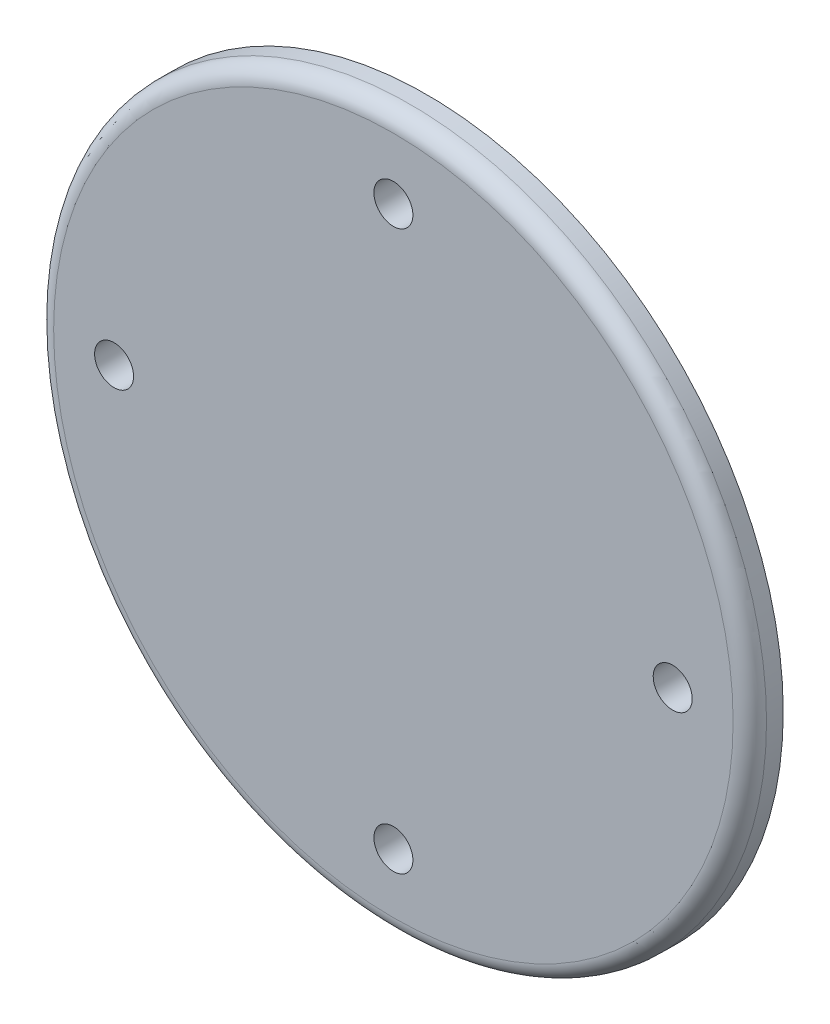
ISO-10303-21;
HEADER;
FILE_DESCRIPTION(('STEP AP214'),'2;1');
FILE_NAME('part.step','',(''),(''),'','','');
FILE_SCHEMA(('AUTOMOTIVE_DESIGN { 1 0 10303 214 1 1 1 1 }'));
ENDSEC;
DATA;
#1=APPLICATION_CONTEXT('core data for automotive mechanical design processes');
#2=APPLICATION_PROTOCOL_DEFINITION('international standard','automotive_design',2000,#1);
#3=PRODUCT_CONTEXT('',#1,'mechanical');
#4=PRODUCT('Part','Part','',(#3));
#5=PRODUCT_RELATED_PRODUCT_CATEGORY('part','',(#4));
#6=PRODUCT_DEFINITION_FORMATION('','',#4);
#7=PRODUCT_DEFINITION_CONTEXT('part definition',#1,'design');
#8=PRODUCT_DEFINITION('design','',#6,#7);
#9=PRODUCT_DEFINITION_SHAPE('','',#8);
#10=(LENGTH_UNIT() NAMED_UNIT(*) SI_UNIT(.MILLI.,.METRE.));
#11=(NAMED_UNIT(*) PLANE_ANGLE_UNIT() SI_UNIT($,.RADIAN.));
#12=(NAMED_UNIT(*) SI_UNIT($,.STERADIAN.) SOLID_ANGLE_UNIT());
#13=UNCERTAINTY_MEASURE_WITH_UNIT(LENGTH_MEASURE(1.E-05),#10,'distance_accuracy_value','');
#14=(GEOMETRIC_REPRESENTATION_CONTEXT(3) GLOBAL_UNCERTAINTY_ASSIGNED_CONTEXT((#13)) GLOBAL_UNIT_ASSIGNED_CONTEXT((#10,
#11,#12)) REPRESENTATION_CONTEXT('',''));
#15=CARTESIAN_POINT('',(0.,0.,0.));
#16=DIRECTION('',(0.,0.,1.));
#17=DIRECTION('',(1.,0.,0.));
#18=AXIS2_PLACEMENT_3D('',#15,#16,#17);
#19=CARTESIAN_POINT('',(0.,0.,30.7823439878234));
#20=DIRECTION('',(0.,0.,1.));
#21=DIRECTION('',(1.,0.,0.));
#22=AXIS2_PLACEMENT_3D('',#19,#20,#21);
#23=CYLINDRICAL_SURFACE('',#22,64.);
#24=CARTESIAN_POINT('',(0.,0.,-3.));
#25=DIRECTION('',(0.,0.,-1.));
#26=DIRECTION('',(-1.,0.,0.));
#27=AXIS2_PLACEMENT_3D('',#24,#25,#26);
#28=CIRCLE('',#27,64.);
#29=CARTESIAN_POINT('',(-64.,0.,-3.));
#30=VERTEX_POINT('',#29);
#31=EDGE_CURVE('E53',#30,#30,#28,.T.);
#32=ORIENTED_EDGE('',*,*,#31,.T.);
#33=EDGE_LOOP('',(#32));
#34=FACE_BOUND('',#33,.T.);
#35=CARTESIAN_POINT('',(0.,0.,-6.));
#36=DIRECTION('',(0.,0.,1.));
#37=DIRECTION('',(1.,0.,0.));
#38=AXIS2_PLACEMENT_3D('',#35,#36,#37);
#39=CIRCLE('',#38,64.);
#40=CARTESIAN_POINT('',(64.,0.,-6.));
#41=VERTEX_POINT('',#40);
#42=EDGE_CURVE('E59',#41,#41,#39,.T.);
#43=ORIENTED_EDGE('',*,*,#42,.T.);
#44=EDGE_LOOP('',(#43));
#45=FACE_BOUND('',#44,.T.);
#46=ADVANCED_FACE('F33',(#34,#45),#23,.T.);
#47=CARTESIAN_POINT('',(0.,64.,-6.));
#48=DIRECTION('',(0.,0.,1.));
#49=DIRECTION('',(1.,0.,0.));
#50=AXIS2_PLACEMENT_3D('',#47,#48,#49);
#51=PLANE('',#50);
#52=CARTESIAN_POINT('',(0.,0.,-6.));
#53=DIRECTION('',(0.,0.,1.));
#54=DIRECTION('',(1.,0.,0.));
#55=AXIS2_PLACEMENT_3D('',#52,#53,#54);
#56=CIRCLE('',#55,35.);
#57=CARTESIAN_POINT('',(35.,0.,-6.));
#58=VERTEX_POINT('',#57);
#59=EDGE_CURVE('E48',#58,#58,#56,.T.);
#60=ORIENTED_EDGE('',*,*,#59,.T.);
#61=EDGE_LOOP('',(#60));
#62=FACE_BOUND('',#61,.T.);
#63=CARTESIAN_POINT('',(-50.1499846954392,-0.149984695439408,-6.));
#64=DIRECTION('',(0.,0.,1.));
#65=DIRECTION('',(1.,0.,0.));
#66=AXIS2_PLACEMENT_3D('',#63,#64,#65);
#67=CIRCLE('',#66,3.5);
#68=CARTESIAN_POINT('',(-46.6499846954392,-0.149984695439408,-6.));
#69=VERTEX_POINT('',#68);
#70=EDGE_CURVE('E74',#69,#69,#67,.F.);
#71=ORIENTED_EDGE('',*,*,#70,.F.);
#72=EDGE_LOOP('',(#71));
#73=FACE_BOUND('',#72,.T.);
#74=CARTESIAN_POINT('',(0.,-50.2999693908785,-6.));
#75=DIRECTION('',(0.,0.,1.));
#76=DIRECTION('',(1.,0.,0.));
#77=AXIS2_PLACEMENT_3D('',#74,#75,#76);
#78=CIRCLE('',#77,3.5);
#79=CARTESIAN_POINT('',(3.5,-50.2999693908785,-6.));
#80=VERTEX_POINT('',#79);
#81=EDGE_CURVE('E82',#80,#80,#78,.F.);
#82=ORIENTED_EDGE('',*,*,#81,.F.);
#83=EDGE_LOOP('',(#82));
#84=FACE_BOUND('',#83,.T.);
#85=CARTESIAN_POINT('',(50.1499846954392,-0.149984695438708,-6.));
#86=DIRECTION('',(0.,0.,1.));
#87=DIRECTION('',(1.,0.,0.));
#88=AXIS2_PLACEMENT_3D('',#85,#86,#87);
#89=CIRCLE('',#88,3.5);
#90=CARTESIAN_POINT('',(53.6499846954392,-0.149984695438708,-6.));
#91=VERTEX_POINT('',#90);
#92=EDGE_CURVE('E75',#91,#91,#89,.F.);
#93=ORIENTED_EDGE('',*,*,#92,.F.);
#94=EDGE_LOOP('',(#93));
#95=FACE_BOUND('',#94,.T.);
#96=CARTESIAN_POINT('',(0.,50.,-6.));
#97=DIRECTION('',(0.,0.,1.));
#98=DIRECTION('',(1.,0.,0.));
#99=AXIS2_PLACEMENT_3D('',#96,#97,#98);
#100=CIRCLE('',#99,3.5);
#101=CARTESIAN_POINT('',(3.5,50.,-6.));
#102=VERTEX_POINT('',#101);
#103=EDGE_CURVE('E68',#102,#102,#100,.F.);
#104=ORIENTED_EDGE('',*,*,#103,.F.);
#105=EDGE_LOOP('',(#104));
#106=FACE_BOUND('',#105,.T.);
#107=ORIENTED_EDGE('',*,*,#42,.F.);
#108=EDGE_LOOP('',(#107));
#109=FACE_BOUND('',#108,.T.);
#110=ADVANCED_FACE('F115',(#62,#73,#84,#95,#106,#109),#51,.F.);
#111=CARTESIAN_POINT('',(0.,0.,30.7823439878234));
#112=DIRECTION('',(0.,0.,1.));
#113=DIRECTION('',(1.,0.,0.));
#114=AXIS2_PLACEMENT_3D('',#111,#112,#113);
#115=CYLINDRICAL_SURFACE('',#114,34.);
#116=CARTESIAN_POINT('',(0.,0.,-7.));
#117=DIRECTION('',(0.,0.,1.));
#118=DIRECTION('',(1.,0.,0.));
#119=AXIS2_PLACEMENT_3D('',#116,#117,#118);
#120=CIRCLE('',#119,34.);
#121=CARTESIAN_POINT('',(34.,0.,-7.));
#122=VERTEX_POINT('',#121);
#123=EDGE_CURVE('E44',#122,#122,#120,.F.);
#124=ORIENTED_EDGE('',*,*,#123,.T.);
#125=EDGE_LOOP('',(#124));
#126=FACE_BOUND('',#125,.T.);
#127=CARTESIAN_POINT('',(0.,0.,-16.));
#128=DIRECTION('',(0.,0.,1.));
#129=DIRECTION('',(1.,0.,0.));
#130=AXIS2_PLACEMENT_3D('',#127,#128,#129);
#131=CIRCLE('',#130,34.);
#132=CARTESIAN_POINT('',(34.,0.,-16.));
#133=VERTEX_POINT('',#132);
#134=EDGE_CURVE('E62',#133,#133,#131,.T.);
#135=ORIENTED_EDGE('',*,*,#134,.T.);
#136=EDGE_LOOP('',(#135));
#137=FACE_BOUND('',#136,.T.);
#138=ADVANCED_FACE('F118',(#126,#137),#115,.T.);
#139=CARTESIAN_POINT('',(0.,34.,-16.));
#140=DIRECTION('',(0.,0.,1.));
#141=DIRECTION('',(1.,0.,0.));
#142=AXIS2_PLACEMENT_3D('',#139,#140,#141);
#143=PLANE('',#142);
#144=ORIENTED_EDGE('',*,*,#134,.F.);
#145=EDGE_LOOP('',(#144));
#146=FACE_BOUND('',#145,.T.);
#147=CARTESIAN_POINT('',(0.,0.,-16.));
#148=DIRECTION('',(0.,0.,1.));
#149=DIRECTION('',(1.,0.,0.));
#150=AXIS2_PLACEMENT_3D('',#147,#148,#149);
#151=CIRCLE('',#150,29.);
#152=CARTESIAN_POINT('',(29.,0.,-16.));
#153=VERTEX_POINT('',#152);
#154=EDGE_CURVE('E65',#153,#153,#151,.T.);
#155=ORIENTED_EDGE('',*,*,#154,.T.);
#156=EDGE_LOOP('',(#155));
#157=FACE_BOUND('',#156,.T.);
#158=ADVANCED_FACE('F166',(#146,#157),#143,.F.);
#159=CARTESIAN_POINT('',(0.,0.,30.7823439878234));
#160=DIRECTION('',(0.,0.,1.));
#161=DIRECTION('',(1.,0.,0.));
#162=AXIS2_PLACEMENT_3D('',#159,#160,#161);
#163=CYLINDRICAL_SURFACE('',#162,29.);
#164=CARTESIAN_POINT('',(0.,0.,-11.));
#165=DIRECTION('',(0.,0.,1.));
#166=DIRECTION('',(1.,0.,0.));
#167=AXIS2_PLACEMENT_3D('',#164,#165,#166);
#168=CIRCLE('',#167,29.);
#169=CARTESIAN_POINT('',(29.,0.,-11.));
#170=VERTEX_POINT('',#169);
#171=EDGE_CURVE('E40',#170,#170,#168,.T.);
#172=ORIENTED_EDGE('',*,*,#171,.T.);
#173=EDGE_LOOP('',(#172));
#174=FACE_BOUND('',#173,.T.);
#175=ORIENTED_EDGE('',*,*,#154,.F.);
#176=EDGE_LOOP('',(#175));
#177=FACE_BOUND('',#176,.T.);
#178=ADVANCED_FACE('F163',(#174,#177),#163,.F.);
#179=CARTESIAN_POINT('',(0.,29.,-6.00000000000001));
#180=DIRECTION('',(0.,0.,1.));
#181=DIRECTION('',(1.,0.,0.));
#182=AXIS2_PLACEMENT_3D('',#179,#180,#181);
#183=PLANE('',#182);
#184=CARTESIAN_POINT('',(0.,0.,-6.00000000000001));
#185=DIRECTION('',(0.,0.,1.));
#186=DIRECTION('',(1.,0.,0.));
#187=AXIS2_PLACEMENT_3D('',#184,#185,#186);
#188=CIRCLE('',#187,24.);
#189=CARTESIAN_POINT('',(24.,0.,-6.00000000000001));
#190=VERTEX_POINT('',#189);
#191=EDGE_CURVE('E10',#190,#190,#188,.F.);
#192=ORIENTED_EDGE('',*,*,#191,.T.);
#193=EDGE_LOOP('',(#192));
#194=FACE_BOUND('',#193,.T.);
#195=ADVANCED_FACE('F100',(#194),#183,.F.);
#196=CARTESIAN_POINT('',(0.,64.,0.));
#197=DIRECTION('',(0.,0.,-1.));
#198=DIRECTION('',(-1.,0.,0.));
#199=AXIS2_PLACEMENT_3D('',#196,#197,#198);
#200=PLANE('',#199);
#201=CARTESIAN_POINT('',(0.,0.,0.));
#202=DIRECTION('',(0.,0.,-1.));
#203=DIRECTION('',(-1.,0.,0.));
#204=AXIS2_PLACEMENT_3D('',#201,#202,#203);
#205=CIRCLE('',#204,61.);
#206=CARTESIAN_POINT('',(-61.,0.,0.));
#207=VERTEX_POINT('',#206);
#208=EDGE_CURVE('E56',#207,#207,#205,.F.);
#209=ORIENTED_EDGE('',*,*,#208,.T.);
#210=EDGE_LOOP('',(#209));
#211=FACE_BOUND('',#210,.T.);
#212=CARTESIAN_POINT('',(-50.1499846954392,-0.149984695439408,0.));
#213=DIRECTION('',(0.,0.,1.));
#214=DIRECTION('',(0.,1.,0.));
#215=AXIS2_PLACEMENT_3D('',#212,#213,#214);
#216=CIRCLE('',#215,3.5);
#217=CARTESIAN_POINT('',(-50.1499846954393,3.35001530456059,0.));
#218=VERTEX_POINT('',#217);
#219=EDGE_CURVE('E85',#218,#218,#216,.T.);
#220=ORIENTED_EDGE('',*,*,#219,.F.);
#221=EDGE_LOOP('',(#220));
#222=FACE_BOUND('',#221,.T.);
#223=CARTESIAN_POINT('',(0.,-50.2999693908785,0.));
#224=DIRECTION('',(0.,0.,1.));
#225=DIRECTION('',(-1.,0.,0.));
#226=AXIS2_PLACEMENT_3D('',#223,#224,#225);
#227=CIRCLE('',#226,3.5);
#228=CARTESIAN_POINT('',(-3.5,-50.2999693908785,0.));
#229=VERTEX_POINT('',#228);
#230=EDGE_CURVE('E78',#229,#229,#227,.T.);
#231=ORIENTED_EDGE('',*,*,#230,.F.);
#232=EDGE_LOOP('',(#231));
#233=FACE_BOUND('',#232,.T.);
#234=CARTESIAN_POINT('',(50.1499846954392,-0.149984695438708,0.));
#235=DIRECTION('',(0.,0.,1.));
#236=DIRECTION('',(0.,-1.,0.));
#237=AXIS2_PLACEMENT_3D('',#234,#235,#236);
#238=CIRCLE('',#237,3.5);
#239=CARTESIAN_POINT('',(50.1499846954393,-3.64998469543871,0.));
#240=VERTEX_POINT('',#239);
#241=EDGE_CURVE('E79',#240,#240,#238,.T.);
#242=ORIENTED_EDGE('',*,*,#241,.F.);
#243=EDGE_LOOP('',(#242));
#244=FACE_BOUND('',#243,.T.);
#245=CARTESIAN_POINT('',(0.,50.,0.));
#246=DIRECTION('',(0.,0.,1.));
#247=DIRECTION('',(1.,0.,0.));
#248=AXIS2_PLACEMENT_3D('',#245,#246,#247);
#249=CIRCLE('',#248,3.5);
#250=CARTESIAN_POINT('',(3.5,50.,0.));
#251=VERTEX_POINT('',#250);
#252=EDGE_CURVE('E71',#251,#251,#249,.T.);
#253=ORIENTED_EDGE('',*,*,#252,.F.);
#254=EDGE_LOOP('',(#253));
#255=FACE_BOUND('',#254,.T.);
#256=ADVANCED_FACE('F96',(#211,#222,#233,#244,#255),#200,.F.);
#257=CARTESIAN_POINT('',(0.,50.,-16.001));
#258=DIRECTION('',(0.,0.,1.));
#259=DIRECTION('',(1.,0.,0.));
#260=AXIS2_PLACEMENT_3D('',#257,#258,#259);
#261=CYLINDRICAL_SURFACE('',#260,3.5);
#262=ORIENTED_EDGE('',*,*,#252,.T.);
#263=EDGE_LOOP('',(#262));
#264=FACE_BOUND('',#263,.T.);
#265=ORIENTED_EDGE('',*,*,#103,.T.);
#266=EDGE_LOOP('',(#265));
#267=FACE_BOUND('',#266,.T.);
#268=ADVANCED_FACE('F99',(#264,#267),#261,.F.);
#269=CARTESIAN_POINT('',(50.1499846954392,-0.149984695438708,-16.001));
#270=DIRECTION('',(0.,0.,1.));
#271=DIRECTION('',(1.,0.,0.));
#272=AXIS2_PLACEMENT_3D('',#269,#270,#271);
#273=CYLINDRICAL_SURFACE('',#272,3.5);
#274=ORIENTED_EDGE('',*,*,#241,.T.);
#275=EDGE_LOOP('',(#274));
#276=FACE_BOUND('',#275,.T.);
#277=ORIENTED_EDGE('',*,*,#92,.T.);
#278=EDGE_LOOP('',(#277));
#279=FACE_BOUND('',#278,.T.);
#280=ADVANCED_FACE('F111',(#276,#279),#273,.F.);
#281=CARTESIAN_POINT('',(0.,-50.2999693908785,-16.001));
#282=DIRECTION('',(0.,0.,1.));
#283=DIRECTION('',(1.,0.,0.));
#284=AXIS2_PLACEMENT_3D('',#281,#282,#283);
#285=CYLINDRICAL_SURFACE('',#284,3.5);
#286=ORIENTED_EDGE('',*,*,#230,.T.);
#287=EDGE_LOOP('',(#286));
#288=FACE_BOUND('',#287,.T.);
#289=ORIENTED_EDGE('',*,*,#81,.T.);
#290=EDGE_LOOP('',(#289));
#291=FACE_BOUND('',#290,.T.);
#292=ADVANCED_FACE('F151',(#288,#291),#285,.F.);
#293=CARTESIAN_POINT('',(-50.1499846954392,-0.149984695439408,-16.001));
#294=DIRECTION('',(0.,0.,1.));
#295=DIRECTION('',(1.,0.,0.));
#296=AXIS2_PLACEMENT_3D('',#293,#294,#295);
#297=CYLINDRICAL_SURFACE('',#296,3.5);
#298=ORIENTED_EDGE('',*,*,#219,.T.);
#299=EDGE_LOOP('',(#298));
#300=FACE_BOUND('',#299,.T.);
#301=ORIENTED_EDGE('',*,*,#70,.T.);
#302=EDGE_LOOP('',(#301));
#303=FACE_BOUND('',#302,.T.);
#304=ADVANCED_FACE('F93',(#300,#303),#297,.F.);
#305=CARTESIAN_POINT('',(0.,0.,-3.));
#306=DIRECTION('',(0.,0.,-1.));
#307=DIRECTION('',(-1.,0.,0.));
#308=AXIS2_PLACEMENT_3D('',#305,#306,#307);
#309=TOROIDAL_SURFACE('',#308,61.,3.);
#310=ORIENTED_EDGE('',*,*,#31,.F.);
#311=EDGE_LOOP('',(#310));
#312=FACE_BOUND('',#311,.T.);
#313=ORIENTED_EDGE('',*,*,#208,.F.);
#314=EDGE_LOOP('',(#313));
#315=FACE_BOUND('',#314,.T.);
#316=ADVANCED_FACE('F130',(#312,#315),#309,.T.);
#317=CARTESIAN_POINT('',(0.,0.,-7.));
#318=DIRECTION('',(0.,0.,1.));
#319=DIRECTION('',(1.,0.,0.));
#320=AXIS2_PLACEMENT_3D('',#317,#318,#319);
#321=TOROIDAL_SURFACE('',#320,35.,1.);
#322=ORIENTED_EDGE('',*,*,#123,.F.);
#323=EDGE_LOOP('',(#322));
#324=FACE_BOUND('',#323,.T.);
#325=ORIENTED_EDGE('',*,*,#59,.F.);
#326=EDGE_LOOP('',(#325));
#327=FACE_BOUND('',#326,.T.);
#328=ADVANCED_FACE('F132',(#324,#327),#321,.F.);
#329=CARTESIAN_POINT('',(0.,0.,-11.));
#330=DIRECTION('',(0.,0.,1.));
#331=DIRECTION('',(1.,0.,0.));
#332=AXIS2_PLACEMENT_3D('',#329,#330,#331);
#333=TOROIDAL_SURFACE('',#332,24.,5.);
#334=ORIENTED_EDGE('',*,*,#191,.F.);
#335=EDGE_LOOP('',(#334));
#336=FACE_BOUND('',#335,.T.);
#337=ORIENTED_EDGE('',*,*,#171,.F.);
#338=EDGE_LOOP('',(#337));
#339=FACE_BOUND('',#338,.T.);
#340=ADVANCED_FACE('F35',(#336,#339),#333,.F.);
#341=CLOSED_SHELL('',(#46,#110,#138,#158,#178,#195,#256,#268,#280,#292,#304,#316,#328,#340));
#342=MANIFOLD_SOLID_BREP('B2',#341);
#343=ADVANCED_BREP_SHAPE_REPRESENTATION('',(#18,#342),#14);
#344=SHAPE_DEFINITION_REPRESENTATION(#9,#343);
ENDSEC;
END-ISO-10303-21;
